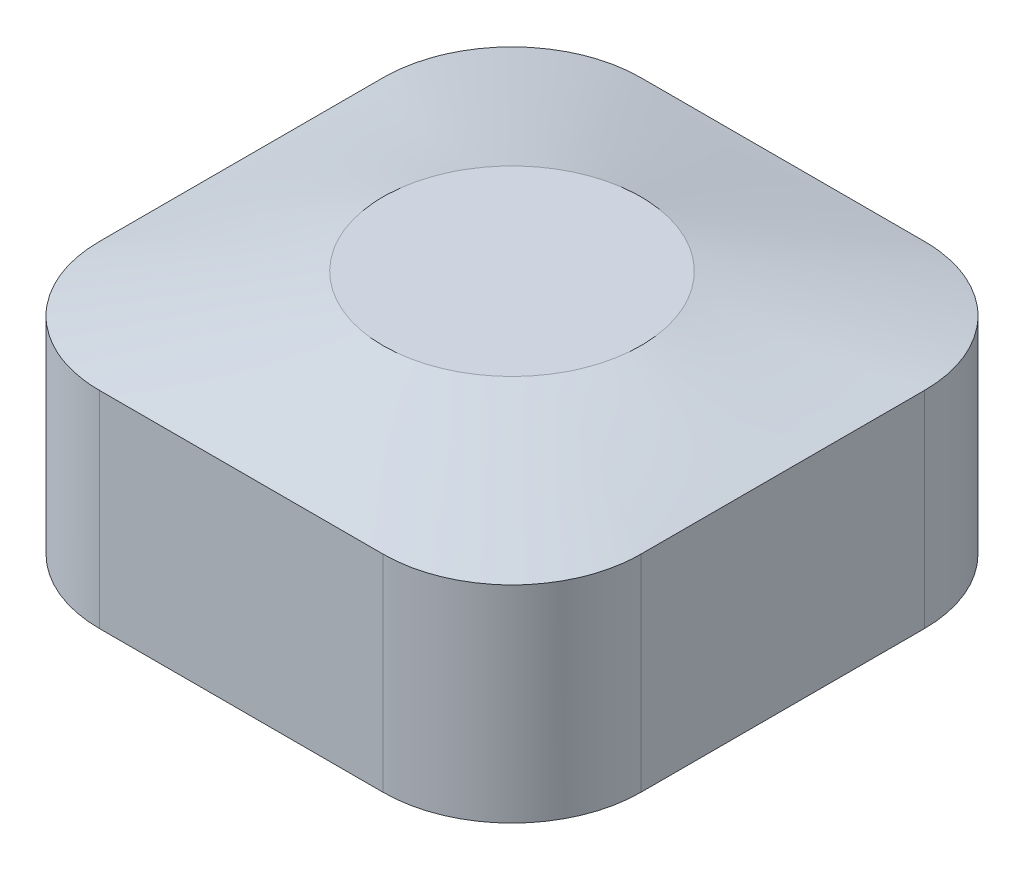
ISO-10303-21;
HEADER;
FILE_DESCRIPTION(('STEP AP214'),'2;1');
FILE_NAME('part.step','',(''),(''),'','','');
FILE_SCHEMA(('AUTOMOTIVE_DESIGN { 1 0 10303 214 1 1 1 1 }'));
ENDSEC;
DATA;
#1=APPLICATION_CONTEXT('core data for automotive mechanical design processes');
#2=APPLICATION_PROTOCOL_DEFINITION('international standard','automotive_design',2000,#1);
#3=PRODUCT_CONTEXT('',#1,'mechanical');
#4=PRODUCT('Part','Part','',(#3));
#5=PRODUCT_RELATED_PRODUCT_CATEGORY('part','',(#4));
#6=PRODUCT_DEFINITION_FORMATION('','',#4);
#7=PRODUCT_DEFINITION_CONTEXT('part definition',#1,'design');
#8=PRODUCT_DEFINITION('design','',#6,#7);
#9=PRODUCT_DEFINITION_SHAPE('','',#8);
#10=(LENGTH_UNIT() NAMED_UNIT(*) SI_UNIT(.MILLI.,.METRE.));
#11=(NAMED_UNIT(*) PLANE_ANGLE_UNIT() SI_UNIT($,.RADIAN.));
#12=(NAMED_UNIT(*) SI_UNIT($,.STERADIAN.) SOLID_ANGLE_UNIT());
#13=UNCERTAINTY_MEASURE_WITH_UNIT(LENGTH_MEASURE(1.E-05),#10,'distance_accuracy_value','');
#14=(GEOMETRIC_REPRESENTATION_CONTEXT(3) GLOBAL_UNCERTAINTY_ASSIGNED_CONTEXT((#13)) GLOBAL_UNIT_ASSIGNED_CONTEXT((#10,
#11,#12)) REPRESENTATION_CONTEXT('',''));
#15=CARTESIAN_POINT('',(0.,0.,0.));
#16=DIRECTION('',(0.,0.,1.));
#17=DIRECTION('',(1.,0.,0.));
#18=AXIS2_PLACEMENT_3D('',#15,#16,#17);
#19=CARTESIAN_POINT('',(0.,8.,21.));
#20=DIRECTION('',(1.,0.,0.));
#21=DIRECTION('',(0.,0.,-1.));
#22=AXIS2_PLACEMENT_3D('',#19,#20,#21);
#23=PLANE('',#22);
#24=DIRECTION('',(0.,0.,-1.));
#25=VECTOR('',#24,1.);
#26=CARTESIAN_POINT('',(0.,8.,21.));
#27=LINE('',#26,#25);
#28=CARTESIAN_POINT('',(0.,8.,5.));
#29=VERTEX_POINT('',#28);
#30=CARTESIAN_POINT('',(0.,8.,16.));
#31=VERTEX_POINT('',#30);
#32=EDGE_CURVE('E338',#29,#31,#27,.F.);
#33=ORIENTED_EDGE('',*,*,#32,.F.);
#34=DIRECTION('',(0.,-1.,0.));
#35=VECTOR('',#34,1.);
#36=CARTESIAN_POINT('',(0.,8.,5.));
#37=LINE('',#36,#35);
#38=CARTESIAN_POINT('',(0.,0.,5.));
#39=VERTEX_POINT('',#38);
#40=EDGE_CURVE('E323',#29,#39,#37,.T.);
#41=ORIENTED_EDGE('',*,*,#40,.T.);
#42=DIRECTION('',(0.,0.,1.));
#43=VECTOR('',#42,1.);
#44=CARTESIAN_POINT('',(0.,0.,21.));
#45=LINE('',#44,#43);
#46=CARTESIAN_POINT('',(0.,0.,16.));
#47=VERTEX_POINT('',#46);
#48=EDGE_CURVE('E408',#39,#47,#45,.T.);
#49=ORIENTED_EDGE('',*,*,#48,.T.);
#50=DIRECTION('',(0.,-1.,0.));
#51=VECTOR('',#50,1.);
#52=CARTESIAN_POINT('',(0.,8.,16.));
#53=LINE('',#52,#51);
#54=EDGE_CURVE('E331',#47,#31,#53,.F.);
#55=ORIENTED_EDGE('',*,*,#54,.T.);
#56=EDGE_LOOP('',(#33,#41,#49,#55));
#57=FACE_BOUND('',#56,.T.);
#58=ADVANCED_FACE('F194',(#57),#23,.F.);
#59=CARTESIAN_POINT('',(21.,8.,21.));
#60=DIRECTION('',(0.,0.,-1.));
#61=DIRECTION('',(-1.,0.,0.));
#62=AXIS2_PLACEMENT_3D('',#59,#60,#61);
#63=PLANE('',#62);
#64=DIRECTION('',(1.,0.,0.));
#65=VECTOR('',#64,1.);
#66=CARTESIAN_POINT('',(21.,0.,21.));
#67=LINE('',#66,#65);
#68=CARTESIAN_POINT('',(5.,0.,21.));
#69=VERTEX_POINT('',#68);
#70=CARTESIAN_POINT('',(16.,0.,21.));
#71=VERTEX_POINT('',#70);
#72=EDGE_CURVE('E406',#69,#71,#67,.T.);
#73=ORIENTED_EDGE('',*,*,#72,.T.);
#74=DIRECTION('',(0.,-1.,0.));
#75=VECTOR('',#74,1.);
#76=CARTESIAN_POINT('',(16.,8.,21.));
#77=LINE('',#76,#75);
#78=CARTESIAN_POINT('',(16.,8.,21.));
#79=VERTEX_POINT('',#78);
#80=EDGE_CURVE('E205',#71,#79,#77,.F.);
#81=ORIENTED_EDGE('',*,*,#80,.T.);
#82=DIRECTION('',(-1.,0.,0.));
#83=VECTOR('',#82,1.);
#84=CARTESIAN_POINT('',(21.,8.,21.));
#85=LINE('',#84,#83);
#86=CARTESIAN_POINT('',(5.,8.,21.));
#87=VERTEX_POINT('',#86);
#88=EDGE_CURVE('E334',#87,#79,#85,.F.);
#89=ORIENTED_EDGE('',*,*,#88,.F.);
#90=DIRECTION('',(0.,-1.,0.));
#91=VECTOR('',#90,1.);
#92=CARTESIAN_POINT('',(5.,8.,21.));
#93=LINE('',#92,#91);
#94=EDGE_CURVE('E383',#87,#69,#93,.T.);
#95=ORIENTED_EDGE('',*,*,#94,.T.);
#96=EDGE_LOOP('',(#73,#81,#89,#95));
#97=FACE_BOUND('',#96,.T.);
#98=ADVANCED_FACE('F540',(#97),#63,.F.);
#99=CARTESIAN_POINT('',(21.,8.,0.));
#100=DIRECTION('',(-1.,0.,0.));
#101=DIRECTION('',(0.,0.,1.));
#102=AXIS2_PLACEMENT_3D('',#99,#100,#101);
#103=PLANE('',#102);
#104=DIRECTION('',(0.,0.,-1.));
#105=VECTOR('',#104,1.);
#106=CARTESIAN_POINT('',(21.,0.,0.));
#107=LINE('',#106,#105);
#108=CARTESIAN_POINT('',(21.,0.,16.));
#109=VERTEX_POINT('',#108);
#110=CARTESIAN_POINT('',(21.,0.,5.));
#111=VERTEX_POINT('',#110);
#112=EDGE_CURVE('E403',#109,#111,#107,.T.);
#113=ORIENTED_EDGE('',*,*,#112,.T.);
#114=DIRECTION('',(0.,-1.,0.));
#115=VECTOR('',#114,1.);
#116=CARTESIAN_POINT('',(21.,8.,5.));
#117=LINE('',#116,#115);
#118=CARTESIAN_POINT('',(21.,8.,5.));
#119=VERTEX_POINT('',#118);
#120=EDGE_CURVE('E385',#111,#119,#117,.F.);
#121=ORIENTED_EDGE('',*,*,#120,.T.);
#122=DIRECTION('',(0.,0.,1.));
#123=VECTOR('',#122,1.);
#124=CARTESIAN_POINT('',(21.,8.,0.));
#125=LINE('',#124,#123);
#126=CARTESIAN_POINT('',(21.,8.,16.));
#127=VERTEX_POINT('',#126);
#128=EDGE_CURVE('E332',#127,#119,#125,.F.);
#129=ORIENTED_EDGE('',*,*,#128,.F.);
#130=DIRECTION('',(0.,-1.,0.));
#131=VECTOR('',#130,1.);
#132=CARTESIAN_POINT('',(21.,8.,16.));
#133=LINE('',#132,#131);
#134=EDGE_CURVE('E326',#127,#109,#133,.T.);
#135=ORIENTED_EDGE('',*,*,#134,.T.);
#136=EDGE_LOOP('',(#113,#121,#129,#135));
#137=FACE_BOUND('',#136,.T.);
#138=ADVANCED_FACE('F538',(#137),#103,.F.);
#139=CARTESIAN_POINT('',(0.,8.,0.));
#140=DIRECTION('',(0.,0.,1.));
#141=DIRECTION('',(1.,0.,0.));
#142=AXIS2_PLACEMENT_3D('',#139,#140,#141);
#143=PLANE('',#142);
#144=DIRECTION('',(-1.,0.,0.));
#145=VECTOR('',#144,1.);
#146=CARTESIAN_POINT('',(0.,0.,0.));
#147=LINE('',#146,#145);
#148=CARTESIAN_POINT('',(16.,0.,0.));
#149=VERTEX_POINT('',#148);
#150=CARTESIAN_POINT('',(5.,0.,0.));
#151=VERTEX_POINT('',#150);
#152=EDGE_CURVE('E314',#149,#151,#147,.T.);
#153=ORIENTED_EDGE('',*,*,#152,.T.);
#154=DIRECTION('',(0.,-1.,0.));
#155=VECTOR('',#154,1.);
#156=CARTESIAN_POINT('',(5.,8.,0.));
#157=LINE('',#156,#155);
#158=CARTESIAN_POINT('',(5.,8.,0.));
#159=VERTEX_POINT('',#158);
#160=EDGE_CURVE('E308',#151,#159,#157,.F.);
#161=ORIENTED_EDGE('',*,*,#160,.T.);
#162=DIRECTION('',(1.,0.,0.));
#163=VECTOR('',#162,1.);
#164=CARTESIAN_POINT('',(0.,8.,0.));
#165=LINE('',#164,#163);
#166=CARTESIAN_POINT('',(16.,8.,0.));
#167=VERTEX_POINT('',#166);
#168=EDGE_CURVE('E199',#167,#159,#165,.F.);
#169=ORIENTED_EDGE('',*,*,#168,.F.);
#170=DIRECTION('',(0.,-1.,0.));
#171=VECTOR('',#170,1.);
#172=CARTESIAN_POINT('',(16.,8.,0.));
#173=LINE('',#172,#171);
#174=EDGE_CURVE('E245',#167,#149,#173,.T.);
#175=ORIENTED_EDGE('',*,*,#174,.T.);
#176=EDGE_LOOP('',(#153,#161,#169,#175));
#177=FACE_BOUND('',#176,.T.);
#178=ADVANCED_FACE('F310',(#177),#143,.F.);
#179=CARTESIAN_POINT('',(0.,0.,0.));
#180=DIRECTION('',(0.,-1.,0.));
#181=DIRECTION('',(0.,0.,-1.));
#182=AXIS2_PLACEMENT_3D('',#179,#180,#181);
#183=PLANE('',#182);
#184=CARTESIAN_POINT('',(5.,0.,5.));
#185=DIRECTION('',(0.,-1.,0.));
#186=DIRECTION('',(0.,0.,1.));
#187=AXIS2_PLACEMENT_3D('',#184,#185,#186);
#188=CIRCLE('',#187,3.5);
#189=CARTESIAN_POINT('',(1.5,0.,5.00000000000002));
#190=VERTEX_POINT('',#189);
#191=CARTESIAN_POINT('',(5.00000000000002,0.,1.5));
#192=VERTEX_POINT('',#191);
#193=EDGE_CURVE('E214',#190,#192,#188,.T.);
#194=ORIENTED_EDGE('',*,*,#193,.F.);
#195=DIRECTION('',(0.,0.,-1.));
#196=VECTOR('',#195,1.);
#197=CARTESIAN_POINT('',(1.5,0.,5.00000000000002));
#198=LINE('',#197,#196);
#199=CARTESIAN_POINT('',(1.5,0.,16.));
#200=VERTEX_POINT('',#199);
#201=EDGE_CURVE('E426',#200,#190,#198,.T.);
#202=ORIENTED_EDGE('',*,*,#201,.F.);
#203=CARTESIAN_POINT('',(5.,0.,16.));
#204=DIRECTION('',(0.,-1.,0.));
#205=DIRECTION('',(0.,0.,-1.));
#206=AXIS2_PLACEMENT_3D('',#203,#204,#205);
#207=CIRCLE('',#206,3.5);
#208=CARTESIAN_POINT('',(5.00000000000002,0.,19.5));
#209=VERTEX_POINT('',#208);
#210=EDGE_CURVE('E430',#209,#200,#207,.T.);
#211=ORIENTED_EDGE('',*,*,#210,.F.);
#212=DIRECTION('',(-1.,0.,0.));
#213=VECTOR('',#212,1.);
#214=CARTESIAN_POINT('',(5.00000000000002,0.,19.5));
#215=LINE('',#214,#213);
#216=CARTESIAN_POINT('',(16.,0.,19.5));
#217=VERTEX_POINT('',#216);
#218=EDGE_CURVE('E433',#217,#209,#215,.T.);
#219=ORIENTED_EDGE('',*,*,#218,.F.);
#220=CARTESIAN_POINT('',(16.,0.,16.));
#221=DIRECTION('',(0.,-1.,0.));
#222=DIRECTION('',(0.,0.,1.));
#223=AXIS2_PLACEMENT_3D('',#220,#221,#222);
#224=CIRCLE('',#223,3.5);
#225=CARTESIAN_POINT('',(19.5,0.,16.));
#226=VERTEX_POINT('',#225);
#227=EDGE_CURVE('E436',#226,#217,#224,.T.);
#228=ORIENTED_EDGE('',*,*,#227,.F.);
#229=DIRECTION('',(0.,0.,1.));
#230=VECTOR('',#229,1.);
#231=CARTESIAN_POINT('',(19.5,0.,5.00000000000002));
#232=LINE('',#231,#230);
#233=CARTESIAN_POINT('',(19.5,0.,5.00000000000002));
#234=VERTEX_POINT('',#233);
#235=EDGE_CURVE('E439',#234,#226,#232,.T.);
#236=ORIENTED_EDGE('',*,*,#235,.F.);
#237=CARTESIAN_POINT('',(16.,0.,5.));
#238=DIRECTION('',(0.,-1.,0.));
#239=DIRECTION('',(0.,0.,-1.));
#240=AXIS2_PLACEMENT_3D('',#237,#238,#239);
#241=CIRCLE('',#240,3.5);
#242=CARTESIAN_POINT('',(16.,0.,1.5));
#243=VERTEX_POINT('',#242);
#244=EDGE_CURVE('E442',#243,#234,#241,.T.);
#245=ORIENTED_EDGE('',*,*,#244,.F.);
#246=DIRECTION('',(1.,0.,0.));
#247=VECTOR('',#246,1.);
#248=CARTESIAN_POINT('',(5.00000000000002,0.,1.5));
#249=LINE('',#248,#247);
#250=EDGE_CURVE('E444',#192,#243,#249,.T.);
#251=ORIENTED_EDGE('',*,*,#250,.F.);
#252=EDGE_LOOP('',(#194,#202,#211,#219,#228,#236,#245,#251));
#253=FACE_BOUND('',#252,.T.);
#254=ORIENTED_EDGE('',*,*,#48,.F.);
#255=CARTESIAN_POINT('',(5.,0.,5.));
#256=DIRECTION('',(0.,-1.,0.));
#257=DIRECTION('',(0.,0.,-1.));
#258=AXIS2_PLACEMENT_3D('',#255,#256,#257);
#259=CIRCLE('',#258,5.);
#260=EDGE_CURVE('E392',#39,#151,#259,.T.);
#261=ORIENTED_EDGE('',*,*,#260,.T.);
#262=ORIENTED_EDGE('',*,*,#152,.F.);
#263=CARTESIAN_POINT('',(16.,0.,5.));
#264=DIRECTION('',(0.,-1.,0.));
#265=DIRECTION('',(0.,0.,-1.));
#266=AXIS2_PLACEMENT_3D('',#263,#264,#265);
#267=CIRCLE('',#266,5.);
#268=EDGE_CURVE('E393',#149,#111,#267,.T.);
#269=ORIENTED_EDGE('',*,*,#268,.T.);
#270=ORIENTED_EDGE('',*,*,#112,.F.);
#271=CARTESIAN_POINT('',(16.,0.,16.));
#272=DIRECTION('',(0.,-1.,0.));
#273=DIRECTION('',(0.,0.,-1.));
#274=AXIS2_PLACEMENT_3D('',#271,#272,#273);
#275=CIRCLE('',#274,5.);
#276=EDGE_CURVE('E302',#109,#71,#275,.T.);
#277=ORIENTED_EDGE('',*,*,#276,.T.);
#278=ORIENTED_EDGE('',*,*,#72,.F.);
#279=CARTESIAN_POINT('',(5.,0.,16.));
#280=DIRECTION('',(0.,-1.,0.));
#281=DIRECTION('',(0.,0.,-1.));
#282=AXIS2_PLACEMENT_3D('',#279,#280,#281);
#283=CIRCLE('',#282,5.);
#284=EDGE_CURVE('E296',#69,#47,#283,.T.);
#285=ORIENTED_EDGE('',*,*,#284,.T.);
#286=EDGE_LOOP('',(#254,#261,#262,#269,#270,#277,#278,#285));
#287=FACE_BOUND('',#286,.T.);
#288=ADVANCED_FACE('F370',(#253,#287),#183,.T.);
#289=CARTESIAN_POINT('',(5.,8.,5.));
#290=DIRECTION('',(0.,-1.,0.));
#291=DIRECTION('',(0.,0.,-1.));
#292=AXIS2_PLACEMENT_3D('',#289,#290,#291);
#293=CYLINDRICAL_SURFACE('',#292,5.);
#294=CARTESIAN_POINT('',(5.,8.,0.));
#295=CARTESIAN_POINT('',(4.85936970750515,7.99999129194583,-1.51218900040859E-05));
#296=CARTESIAN_POINT('',(4.71874158628322,7.99997355052632,0.00593242913028755));
#297=CARTESIAN_POINT('',(4.43849150855544,7.99994383210181,0.02964365638705));
#298=CARTESIAN_POINT('',(4.29886950408125,7.99993185482019,0.0474067654780275));
#299=CARTESIAN_POINT('',(4.02172453622357,7.99993748827671,0.0946220630589021));
#300=CARTESIAN_POINT('',(3.88420006652193,7.99995507666503,0.124065409155688));
#301=CARTESIAN_POINT('',(3.61212052836341,8.00000385765287,0.194426989417875));
#302=CARTESIAN_POINT('',(3.47756542365326,8.0000350500862,0.235345083403256));
#303=CARTESIAN_POINT('',(3.21231481971966,8.00006332591643,0.328389383977522));
#304=CARTESIAN_POINT('',(3.08162121354892,8.00006039285302,0.380520987464815));
#305=CARTESIAN_POINT('',(2.82508938973149,8.0000218352322,0.49561021061234));
#306=CARTESIAN_POINT('',(2.69925122203098,7.99998621033859,0.558567941600787));
#307=CARTESIAN_POINT('',(2.45334849129507,7.99994136349724,0.69484927074059));
#308=CARTESIAN_POINT('',(2.33328289972929,7.99993213682872,0.76817101303993));
#309=CARTESIAN_POINT('',(2.0997553303439,7.99994417630345,0.924667218210526));
#310=CARTESIAN_POINT('',(1.98629331698032,7.99996544228255,1.00784162804216));
#311=CARTESIAN_POINT('',(1.76677985078452,8.00002266889553,1.18345136293889));
#312=CARTESIAN_POINT('',(1.6607283211054,8.00005862937701,1.27588659194486));
#313=CARTESIAN_POINT('',(1.45678778632512,8.00008245589123,1.46936217396569));
#314=CARTESIAN_POINT('',(1.35889882473455,8.00007032166764,1.57040257284465));
#315=CARTESIAN_POINT('',(1.1719784250637,8.00002319960231,1.78037150661225));
#316=CARTESIAN_POINT('',(1.08294712386945,7.99998821140747,1.88930016336087));
#317=CARTESIAN_POINT('',(0.914346610479957,7.99994277874181,2.11430988698469));
#318=CARTESIAN_POINT('',(0.834780775182089,7.99993234300555,2.23039348416636));
#319=CARTESIAN_POINT('',(0.685712713012557,7.99994312804332,2.46885474686353));
#320=CARTESIAN_POINT('',(0.61621064840524,7.99996434932771,2.59123251382069));
#321=CARTESIAN_POINT('',(0.487765911822458,8.00001884781211,2.84140862584924));
#322=CARTESIAN_POINT('',(0.428823284975618,8.00005212506364,2.96920699408416));
#323=CARTESIAN_POINT('',(0.321942278865139,8.00006730052975,3.22925879536026));
#324=CARTESIAN_POINT('',(0.273998620558982,8.00004922344826,3.36151005609974));
#325=CARTESIAN_POINT('',(0.189431200858348,8.0000022457977,3.62953178129152));
#326=CARTESIAN_POINT('',(0.152804974755087,7.9999733475883,3.7653014725098));
#327=CARTESIAN_POINT('',(0.0814490492722305,7.99993241236263,4.08246147584534));
#328=CARTESIAN_POINT('',(0.0509066661031185,7.99992849172685,4.26482114457164));
#329=CARTESIAN_POINT('',(0.0203662633614121,7.99995273146828,4.5398246714185));
#330=CARTESIAN_POINT('',(0.0127316645339142,7.99996581731495,4.63168980797857));
#331=CARTESIAN_POINT('',(0.00254914589946658,7.99998870102009,4.81569576368986));
#332=CARTESIAN_POINT('',(9.04145101973112E-07,7.99999849908663,4.90783656502278));
#333=CARTESIAN_POINT('',(0.,8.,5.));
#334=B_SPLINE_CURVE_WITH_KNOTS('',3,(#294,#295,#296,#297,#298,#299,#300,#301,#302,#303,#304,
#305,#306,#307,#308,#309,#310,#311,#312,#313,#314,#315,#316,#317,#318,#319,#320,#321,#322,#323,
#324,#325,#326,#327,#328,#329,#330,#331,#332,#333),.UNSPECIFIED.,.F.,.F.,(4,2,2,2,2,2,2,2,2,2,2,
2,2,2,2,2,2,2,2,4),(0.,0.421762106520806,0.843503969967427,1.26492716586672,1.6863452137192,
2.10796653956105,2.52959220131679,2.95114245926693,3.37269044799903,3.79423406461929,
4.21577992813647,4.63733230520033,5.05903462702221,5.48074374745231,5.90245467012786,
6.3239627638537,6.74537899680378,7.29879131433035,7.57521872703975,7.85162864237094),.UNSPECIFIED.);
#335=EDGE_CURVE('E320',#159,#29,#334,.T.);
#336=ORIENTED_EDGE('',*,*,#335,.F.);
#337=ORIENTED_EDGE('',*,*,#160,.F.);
#338=ORIENTED_EDGE('',*,*,#260,.F.);
#339=ORIENTED_EDGE('',*,*,#40,.F.);
#340=EDGE_LOOP('',(#336,#337,#338,#339));
#341=FACE_BOUND('',#340,.T.);
#342=ADVANCED_FACE('F321',(#341),#293,.T.);
#343=CARTESIAN_POINT('',(16.,8.,5.));
#344=DIRECTION('',(0.,-1.,0.));
#345=DIRECTION('',(0.,0.,-1.));
#346=AXIS2_PLACEMENT_3D('',#343,#344,#345);
#347=CYLINDRICAL_SURFACE('',#346,5.);
#348=CARTESIAN_POINT('',(21.,8.,5.));
#349=CARTESIAN_POINT('',(21.00001512189,7.99999129194583,4.85936970750515));
#350=CARTESIAN_POINT('',(20.9940675708697,7.99997355052632,4.71874158628322));
#351=CARTESIAN_POINT('',(20.970356343613,7.99994383210181,4.43849150855545));
#352=CARTESIAN_POINT('',(20.952593234522,7.99993185482019,4.29886950408125));
#353=CARTESIAN_POINT('',(20.9053779369411,7.99993748827672,4.02172453622357));
#354=CARTESIAN_POINT('',(20.8759345908443,7.99995507666504,3.88420006652193));
#355=CARTESIAN_POINT('',(20.8055730105821,8.00000385765288,3.61212052836341));
#356=CARTESIAN_POINT('',(20.7646549165967,8.00003505008621,3.47756542365327));
#357=CARTESIAN_POINT('',(20.6716106160225,8.00006332591644,3.21231481971966));
#358=CARTESIAN_POINT('',(20.6194790125352,8.00006039285303,3.08162121354892));
#359=CARTESIAN_POINT('',(20.5043897893877,8.00002183523221,2.82508938973149));
#360=CARTESIAN_POINT('',(20.4414320583992,7.99998621033859,2.69925122203098));
#361=CARTESIAN_POINT('',(20.3051507292594,7.99994136349724,2.45334849129507));
#362=CARTESIAN_POINT('',(20.2318289869601,7.99993213682872,2.33328289972929));
#363=CARTESIAN_POINT('',(20.0753327817895,7.99994417630345,2.0997553303439));
#364=CARTESIAN_POINT('',(19.9921583719578,7.99996544228254,1.98629331698032));
#365=CARTESIAN_POINT('',(19.8165486370611,8.00002266889553,1.76677985078452));
#366=CARTESIAN_POINT('',(19.7241134080551,8.000058629377,1.6607283211054));
#367=CARTESIAN_POINT('',(19.5306378260343,8.00008245589123,1.45678778632511));
#368=CARTESIAN_POINT('',(19.4295974271554,8.00007032166762,1.35889882473455));
#369=CARTESIAN_POINT('',(19.2196284933878,8.0000231996023,1.1719784250637));
#370=CARTESIAN_POINT('',(19.1106998366391,7.99998821140745,1.08294712386945));
#371=CARTESIAN_POINT('',(18.8856901130153,7.9999427787418,0.914346610479958));
#372=CARTESIAN_POINT('',(18.7696065158336,7.99993234300554,0.83478077518209));
#373=CARTESIAN_POINT('',(18.5311452531365,7.99994312804331,0.685712713012558));
#374=CARTESIAN_POINT('',(18.4087674861793,7.99996434932772,0.61621064840524));
#375=CARTESIAN_POINT('',(18.1585913741508,8.00001884781212,0.487765911822457));
#376=CARTESIAN_POINT('',(18.0307930059158,8.00005212506364,0.428823284975617));
#377=CARTESIAN_POINT('',(17.7707412046397,8.00006730052976,0.321942278865138));
#378=CARTESIAN_POINT('',(17.6384899439003,8.00004922344826,0.273998620558981));
#379=CARTESIAN_POINT('',(17.3704682187085,8.0000022457977,0.189431200858348));
#380=CARTESIAN_POINT('',(17.2346985274902,7.9999733475883,0.152804974755087));
#381=CARTESIAN_POINT('',(16.9175385241547,7.99993241236262,0.08144904927223));
#382=CARTESIAN_POINT('',(16.7351788554284,7.99992849172686,0.0509066661031176));
#383=CARTESIAN_POINT('',(16.4601753285815,7.99995273146829,0.0203662633614115));
#384=CARTESIAN_POINT('',(16.3683101920214,7.99996581731495,0.0127316645339139));
#385=CARTESIAN_POINT('',(16.1843042363101,7.99998870102009,0.00254914589946659));
#386=CARTESIAN_POINT('',(16.0921634349772,7.99999849908663,9.04145101966269E-07));
#387=CARTESIAN_POINT('',(16.,8.,0.));
#388=B_SPLINE_CURVE_WITH_KNOTS('',3,(#348,#349,#350,#351,#352,#353,#354,#355,#356,#357,#358,
#359,#360,#361,#362,#363,#364,#365,#366,#367,#368,#369,#370,#371,#372,#373,#374,#375,#376,#377,
#378,#379,#380,#381,#382,#383,#384,#385,#386,#387),.UNSPECIFIED.,.F.,.F.,(4,2,2,2,2,2,2,2,2,2,2,
2,2,2,2,2,2,2,2,4),(0.,0.421762106520807,0.843503969967428,1.26492716586672,1.6863452137192,
2.10796653956106,2.5295922013168,2.95114245926694,3.37269044799903,3.79423406461929,
4.21577992813647,4.63733230520033,5.05903462702222,5.48074374745232,5.90245467012787,
6.32396276385371,6.74537899680379,7.29879131433036,7.57521872703976,7.85162864237095),.UNSPECIFIED.);
#389=EDGE_CURVE('E327',#119,#167,#388,.T.);
#390=ORIENTED_EDGE('',*,*,#389,.F.);
#391=ORIENTED_EDGE('',*,*,#120,.F.);
#392=ORIENTED_EDGE('',*,*,#268,.F.);
#393=ORIENTED_EDGE('',*,*,#174,.F.);
#394=EDGE_LOOP('',(#390,#391,#392,#393));
#395=FACE_BOUND('',#394,.T.);
#396=ADVANCED_FACE('F362',(#395),#347,.T.);
#397=CARTESIAN_POINT('',(16.,8.,16.));
#398=DIRECTION('',(0.,-1.,0.));
#399=DIRECTION('',(0.,0.,-1.));
#400=AXIS2_PLACEMENT_3D('',#397,#398,#399);
#401=CYLINDRICAL_SURFACE('',#400,5.);
#402=CARTESIAN_POINT('',(16.,8.,21.));
#403=CARTESIAN_POINT('',(16.1406302924949,7.99999129194584,21.00001512189));
#404=CARTESIAN_POINT('',(16.2812584137168,7.99997355052632,20.9940675708697));
#405=CARTESIAN_POINT('',(16.5615084914446,7.99994383210182,20.970356343613));
#406=CARTESIAN_POINT('',(16.7011304959188,7.99993185482019,20.952593234522));
#407=CARTESIAN_POINT('',(16.9782754637765,7.99993748827672,20.9053779369411));
#408=CARTESIAN_POINT('',(17.1157999334781,7.99995507666504,20.8759345908443));
#409=CARTESIAN_POINT('',(17.3878794716366,8.00000385765288,20.8055730105821));
#410=CARTESIAN_POINT('',(17.5224345763468,8.00003505008621,20.7646549165967));
#411=CARTESIAN_POINT('',(17.7876851802804,8.00006332591644,20.6716106160225));
#412=CARTESIAN_POINT('',(17.9183787864511,8.00006039285303,20.6194790125352));
#413=CARTESIAN_POINT('',(18.1749106102685,8.0000218352322,20.5043897893877));
#414=CARTESIAN_POINT('',(18.300748777969,7.99998621033859,20.4414320583992));
#415=CARTESIAN_POINT('',(18.5466515087049,7.99994136349724,20.3051507292594));
#416=CARTESIAN_POINT('',(18.6667171002707,7.99993213682872,20.2318289869601));
#417=CARTESIAN_POINT('',(18.9002446696561,7.99994417630344,20.0753327817895));
#418=CARTESIAN_POINT('',(19.0137066830197,7.99996544228254,19.9921583719578));
#419=CARTESIAN_POINT('',(19.2332201492155,8.00002266889553,19.8165486370611));
#420=CARTESIAN_POINT('',(19.3392716788946,8.000058629377,19.7241134080551));
#421=CARTESIAN_POINT('',(19.5432122136749,8.00008245589123,19.5306378260343));
#422=CARTESIAN_POINT('',(19.6411011752655,8.00007032166763,19.4295974271553));
#423=CARTESIAN_POINT('',(19.8280215749363,8.0000231996023,19.2196284933877));
#424=CARTESIAN_POINT('',(19.9170528761306,7.99998821140745,19.1106998366391));
#425=CARTESIAN_POINT('',(20.0856533895201,7.9999427787418,18.8856901130153));
#426=CARTESIAN_POINT('',(20.1652192248179,7.99993234300554,18.7696065158336));
#427=CARTESIAN_POINT('',(20.3142872869875,7.99994312804331,18.5311452531365));
#428=CARTESIAN_POINT('',(20.3837893515948,7.99996434932771,18.4087674861793));
#429=CARTESIAN_POINT('',(20.5122340881776,8.00001884781211,18.1585913741507));
#430=CARTESIAN_POINT('',(20.5711767150244,8.00005212506364,18.0307930059158));
#431=CARTESIAN_POINT('',(20.6780577211349,8.00006730052976,17.7707412046397));
#432=CARTESIAN_POINT('',(20.726001379441,8.00004922344826,17.6384899439002));
#433=CARTESIAN_POINT('',(20.8105687991417,8.0000022457977,17.3704682187085));
#434=CARTESIAN_POINT('',(20.8471950252449,7.9999733475883,17.2346985274902));
#435=CARTESIAN_POINT('',(20.9185509507278,7.99993241236263,16.9175385241546));
#436=CARTESIAN_POINT('',(20.9490933338969,7.99992849172686,16.7351788554283));
#437=CARTESIAN_POINT('',(20.9796337366386,7.99995273146829,16.4601753285815));
#438=CARTESIAN_POINT('',(20.9872683354661,7.99996581731495,16.3683101920214));
#439=CARTESIAN_POINT('',(20.9974508541005,7.99998870102009,16.1843042363101));
#440=CARTESIAN_POINT('',(20.9999990958549,7.99999849908663,16.0921634349772));
#441=CARTESIAN_POINT('',(21.,8.,16.));
#442=B_SPLINE_CURVE_WITH_KNOTS('',3,(#402,#403,#404,#405,#406,#407,#408,#409,#410,#411,#412,
#413,#414,#415,#416,#417,#418,#419,#420,#421,#422,#423,#424,#425,#426,#427,#428,#429,#430,#431,
#432,#433,#434,#435,#436,#437,#438,#439,#440,#441),.UNSPECIFIED.,.F.,.F.,(4,2,2,2,2,2,2,2,2,2,2,
2,2,2,2,2,2,2,2,4),(0.,0.42176210652081,0.843503969967436,1.26492716586673,1.68634521371921,
2.10796653956106,2.5295922013168,2.95114245926694,3.37269044799904,3.7942340646193,
4.21577992813648,4.63733230520035,5.05903462702223,5.48074374745233,5.90245467012788,
6.32396276385373,6.7453789968038,7.29879131433036,7.57521872703976,7.85162864237093),.UNSPECIFIED.);
#443=EDGE_CURVE('E349',#79,#127,#442,.T.);
#444=ORIENTED_EDGE('',*,*,#443,.F.);
#445=ORIENTED_EDGE('',*,*,#80,.F.);
#446=ORIENTED_EDGE('',*,*,#276,.F.);
#447=ORIENTED_EDGE('',*,*,#134,.F.);
#448=EDGE_LOOP('',(#444,#445,#446,#447));
#449=FACE_BOUND('',#448,.T.);
#450=ADVANCED_FACE('F359',(#449),#401,.T.);
#451=CARTESIAN_POINT('',(5.,8.,16.));
#452=DIRECTION('',(0.,-1.,0.));
#453=DIRECTION('',(0.,0.,-1.));
#454=AXIS2_PLACEMENT_3D('',#451,#452,#453);
#455=CYLINDRICAL_SURFACE('',#454,5.);
#456=CARTESIAN_POINT('',(0.,8.,16.));
#457=CARTESIAN_POINT('',(-1.5121890003863E-05,7.99999129194584,16.1406302924949));
#458=CARTESIAN_POINT('',(0.00593242913028772,7.99997355052632,16.2812584137168));
#459=CARTESIAN_POINT('',(0.0296436563870498,7.99994383210182,16.5615084914446));
#460=CARTESIAN_POINT('',(0.0474067654780271,7.99993185482019,16.7011304959188));
#461=CARTESIAN_POINT('',(0.0946220630589016,7.99993748827671,16.9782754637764));
#462=CARTESIAN_POINT('',(0.124065409155687,7.99995507666504,17.1157999334781));
#463=CARTESIAN_POINT('',(0.194426989417875,8.00000385765287,17.3878794716366));
#464=CARTESIAN_POINT('',(0.235345083403256,8.0000350500862,17.5224345763467));
#465=CARTESIAN_POINT('',(0.328389383977522,8.00006332591644,17.7876851802803));
#466=CARTESIAN_POINT('',(0.380520987464814,8.00006039285303,17.9183787864511));
#467=CARTESIAN_POINT('',(0.495610210612339,8.0000218352322,18.1749106102685));
#468=CARTESIAN_POINT('',(0.558567941600787,7.99998621033859,18.300748777969));
#469=CARTESIAN_POINT('',(0.694849270740591,7.99994136349724,18.5466515087049));
#470=CARTESIAN_POINT('',(0.768171013039931,7.99993213682872,18.6667171002707));
#471=CARTESIAN_POINT('',(0.924667218210528,7.99994417630345,18.9002446696561));
#472=CARTESIAN_POINT('',(1.00784162804216,7.99996544228255,19.0137066830197));
#473=CARTESIAN_POINT('',(1.18345136293889,8.00002266889553,19.2332201492155));
#474=CARTESIAN_POINT('',(1.27588659194487,8.00005862937701,19.3392716788946));
#475=CARTESIAN_POINT('',(1.4693621739657,8.00008245589123,19.5432122136749));
#476=CARTESIAN_POINT('',(1.57040257284465,8.00007032166763,19.6411011752655));
#477=CARTESIAN_POINT('',(1.78037150661225,8.00002319960231,19.8280215749363));
#478=CARTESIAN_POINT('',(1.88930016336088,7.99998821140746,19.9170528761306));
#479=CARTESIAN_POINT('',(2.11430988698469,7.9999427787418,20.0856533895201));
#480=CARTESIAN_POINT('',(2.23039348416636,7.99993234300554,20.1652192248179));
#481=CARTESIAN_POINT('',(2.46885474686354,7.99994312804331,20.3142872869875));
#482=CARTESIAN_POINT('',(2.5912325138207,7.99996434932771,20.3837893515948));
#483=CARTESIAN_POINT('',(2.84140862584925,8.00001884781211,20.5122340881776));
#484=CARTESIAN_POINT('',(2.96920699408417,8.00005212506364,20.5711767150244));
#485=CARTESIAN_POINT('',(3.22925879536027,8.00006730052975,20.6780577211349));
#486=CARTESIAN_POINT('',(3.36151005609975,8.00004922344826,20.726001379441));
#487=CARTESIAN_POINT('',(3.62953178129152,8.0000022457977,20.8105687991417));
#488=CARTESIAN_POINT('',(3.76530147250981,7.9999733475883,20.8471950252449));
#489=CARTESIAN_POINT('',(4.08246147584534,7.99993241236262,20.9185509507278));
#490=CARTESIAN_POINT('',(4.26482114457164,7.99992849172686,20.9490933338969));
#491=CARTESIAN_POINT('',(4.53982467141851,7.99995273146829,20.9796337366386));
#492=CARTESIAN_POINT('',(4.63168980797857,7.99996581731495,20.9872683354661));
#493=CARTESIAN_POINT('',(4.81569576368986,7.99998870102009,20.9974508541005));
#494=CARTESIAN_POINT('',(4.90783656502278,7.99999849908663,20.9999990958549));
#495=CARTESIAN_POINT('',(5.,8.,21.));
#496=B_SPLINE_CURVE_WITH_KNOTS('',3,(#456,#457,#458,#459,#460,#461,#462,#463,#464,#465,#466,
#467,#468,#469,#470,#471,#472,#473,#474,#475,#476,#477,#478,#479,#480,#481,#482,#483,#484,#485,
#486,#487,#488,#489,#490,#491,#492,#493,#494,#495),.UNSPECIFIED.,.F.,.F.,(4,2,2,2,2,2,2,2,2,2,2,
2,2,2,2,2,2,2,2,4),(0.,0.421762106520806,0.843503969967431,1.26492716586672,1.6863452137192,
2.10796653956106,2.5295922013168,2.95114245926694,3.37269044799903,3.79423406461929,
4.21577992813648,4.63733230520034,5.05903462702223,5.48074374745233,5.90245467012787,
6.32396276385372,6.74537899680379,7.29879131433036,7.57521872703976,7.85162864237095),.UNSPECIFIED.);
#497=EDGE_CURVE('E316',#31,#87,#496,.T.);
#498=ORIENTED_EDGE('',*,*,#497,.F.);
#499=ORIENTED_EDGE('',*,*,#54,.F.);
#500=ORIENTED_EDGE('',*,*,#284,.F.);
#501=ORIENTED_EDGE('',*,*,#94,.F.);
#502=EDGE_LOOP('',(#498,#499,#500,#501));
#503=FACE_BOUND('',#502,.T.);
#504=ADVANCED_FACE('F196',(#503),#455,.T.);
#505=CARTESIAN_POINT('',(5.,6.5,5.));
#506=DIRECTION('',(0.,-1.,0.));
#507=DIRECTION('',(0.,0.,-1.));
#508=AXIS2_PLACEMENT_3D('',#505,#506,#507);
#509=CYLINDRICAL_SURFACE('',#508,3.5);
#510=ORIENTED_EDGE('',*,*,#193,.T.);
#511=DIRECTION('',(0.,-1.,0.));
#512=VECTOR('',#511,1.);
#513=CARTESIAN_POINT('',(5.00000000000002,6.5,1.5));
#514=LINE('',#513,#512);
#515=CARTESIAN_POINT('',(5.00000000000002,6.5,1.5));
#516=VERTEX_POINT('',#515);
#517=EDGE_CURVE('E411',#516,#192,#514,.T.);
#518=ORIENTED_EDGE('',*,*,#517,.F.);
#519=CARTESIAN_POINT('',(5.,6.5,5.));
#520=DIRECTION('',(0.,-1.,0.));
#521=DIRECTION('',(0.,0.,1.));
#522=AXIS2_PLACEMENT_3D('',#519,#520,#521);
#523=CIRCLE('',#522,3.5);
#524=CARTESIAN_POINT('',(1.5,6.5,5.00000000000002));
#525=VERTEX_POINT('',#524);
#526=EDGE_CURVE('E429',#525,#516,#523,.T.);
#527=ORIENTED_EDGE('',*,*,#526,.F.);
#528=DIRECTION('',(0.,-1.,0.));
#529=VECTOR('',#528,1.);
#530=CARTESIAN_POINT('',(1.5,6.5,5.00000000000002));
#531=LINE('',#530,#529);
#532=EDGE_CURVE('E410',#525,#190,#531,.T.);
#533=ORIENTED_EDGE('',*,*,#532,.T.);
#534=EDGE_LOOP('',(#510,#518,#527,#533));
#535=FACE_BOUND('',#534,.T.);
#536=ADVANCED_FACE('F508',(#535),#509,.F.);
#537=CARTESIAN_POINT('',(1.5,6.5,5.00000000000002));
#538=DIRECTION('',(-1.,0.,0.));
#539=DIRECTION('',(0.,0.,1.));
#540=AXIS2_PLACEMENT_3D('',#537,#538,#539);
#541=PLANE('',#540);
#542=ORIENTED_EDGE('',*,*,#201,.T.);
#543=ORIENTED_EDGE('',*,*,#532,.F.);
#544=DIRECTION('',(0.,0.,-1.));
#545=VECTOR('',#544,1.);
#546=CARTESIAN_POINT('',(1.5,6.5,5.00000000000002));
#547=LINE('',#546,#545);
#548=CARTESIAN_POINT('',(1.5,6.5,16.));
#549=VERTEX_POINT('',#548);
#550=EDGE_CURVE('E413',#549,#525,#547,.T.);
#551=ORIENTED_EDGE('',*,*,#550,.F.);
#552=DIRECTION('',(0.,-1.,0.));
#553=VECTOR('',#552,1.);
#554=CARTESIAN_POINT('',(1.5,6.5,16.));
#555=LINE('',#554,#553);
#556=EDGE_CURVE('E423',#549,#200,#555,.T.);
#557=ORIENTED_EDGE('',*,*,#556,.T.);
#558=EDGE_LOOP('',(#542,#543,#551,#557));
#559=FACE_BOUND('',#558,.T.);
#560=ADVANCED_FACE('F504',(#559),#541,.F.);
#561=CARTESIAN_POINT('',(5.,6.5,16.));
#562=DIRECTION('',(0.,-1.,0.));
#563=DIRECTION('',(0.,0.,-1.));
#564=AXIS2_PLACEMENT_3D('',#561,#562,#563);
#565=CYLINDRICAL_SURFACE('',#564,3.5);
#566=ORIENTED_EDGE('',*,*,#210,.T.);
#567=ORIENTED_EDGE('',*,*,#556,.F.);
#568=CARTESIAN_POINT('',(5.,6.5,16.));
#569=DIRECTION('',(0.,-1.,0.));
#570=DIRECTION('',(0.,0.,-1.));
#571=AXIS2_PLACEMENT_3D('',#568,#569,#570);
#572=CIRCLE('',#571,3.5);
#573=CARTESIAN_POINT('',(5.00000000000002,6.5,19.5));
#574=VERTEX_POINT('',#573);
#575=EDGE_CURVE('E450',#574,#549,#572,.T.);
#576=ORIENTED_EDGE('',*,*,#575,.F.);
#577=DIRECTION('',(0.,-1.,0.));
#578=VECTOR('',#577,1.);
#579=CARTESIAN_POINT('',(5.00000000000002,6.5,19.5));
#580=LINE('',#579,#578);
#581=EDGE_CURVE('E421',#574,#209,#580,.T.);
#582=ORIENTED_EDGE('',*,*,#581,.T.);
#583=EDGE_LOOP('',(#566,#567,#576,#582));
#584=FACE_BOUND('',#583,.T.);
#585=ADVANCED_FACE('F507',(#584),#565,.F.);
#586=CARTESIAN_POINT('',(5.00000000000002,6.5,19.5));
#587=DIRECTION('',(0.,0.,1.));
#588=DIRECTION('',(1.,0.,0.));
#589=AXIS2_PLACEMENT_3D('',#586,#587,#588);
#590=PLANE('',#589);
#591=ORIENTED_EDGE('',*,*,#218,.T.);
#592=ORIENTED_EDGE('',*,*,#581,.F.);
#593=DIRECTION('',(-1.,0.,0.));
#594=VECTOR('',#593,1.);
#595=CARTESIAN_POINT('',(5.00000000000002,6.5,19.5));
#596=LINE('',#595,#594);
#597=CARTESIAN_POINT('',(16.,6.5,19.5));
#598=VERTEX_POINT('',#597);
#599=EDGE_CURVE('E453',#598,#574,#596,.T.);
#600=ORIENTED_EDGE('',*,*,#599,.F.);
#601=DIRECTION('',(0.,-1.,0.));
#602=VECTOR('',#601,1.);
#603=CARTESIAN_POINT('',(16.,6.5,19.5));
#604=LINE('',#603,#602);
#605=EDGE_CURVE('E419',#598,#217,#604,.T.);
#606=ORIENTED_EDGE('',*,*,#605,.T.);
#607=EDGE_LOOP('',(#591,#592,#600,#606));
#608=FACE_BOUND('',#607,.T.);
#609=ADVANCED_FACE('F512',(#608),#590,.F.);
#610=CARTESIAN_POINT('',(16.,6.5,16.));
#611=DIRECTION('',(0.,-1.,0.));
#612=DIRECTION('',(0.,0.,-1.));
#613=AXIS2_PLACEMENT_3D('',#610,#611,#612);
#614=CYLINDRICAL_SURFACE('',#613,3.5);
#615=ORIENTED_EDGE('',*,*,#227,.T.);
#616=ORIENTED_EDGE('',*,*,#605,.F.);
#617=CARTESIAN_POINT('',(16.,6.5,16.));
#618=DIRECTION('',(0.,-1.,0.));
#619=DIRECTION('',(0.,0.,1.));
#620=AXIS2_PLACEMENT_3D('',#617,#618,#619);
#621=CIRCLE('',#620,3.5);
#622=CARTESIAN_POINT('',(19.5,6.5,16.));
#623=VERTEX_POINT('',#622);
#624=EDGE_CURVE('E456',#623,#598,#621,.T.);
#625=ORIENTED_EDGE('',*,*,#624,.F.);
#626=DIRECTION('',(0.,-1.,0.));
#627=VECTOR('',#626,1.);
#628=CARTESIAN_POINT('',(19.5,6.5,16.));
#629=LINE('',#628,#627);
#630=EDGE_CURVE('E417',#623,#226,#629,.T.);
#631=ORIENTED_EDGE('',*,*,#630,.T.);
#632=EDGE_LOOP('',(#615,#616,#625,#631));
#633=FACE_BOUND('',#632,.T.);
#634=ADVANCED_FACE('F516',(#633),#614,.F.);
#635=CARTESIAN_POINT('',(19.5,6.5,5.00000000000002));
#636=DIRECTION('',(1.,0.,0.));
#637=DIRECTION('',(0.,0.,-1.));
#638=AXIS2_PLACEMENT_3D('',#635,#636,#637);
#639=PLANE('',#638);
#640=ORIENTED_EDGE('',*,*,#235,.T.);
#641=ORIENTED_EDGE('',*,*,#630,.F.);
#642=DIRECTION('',(0.,0.,1.));
#643=VECTOR('',#642,1.);
#644=CARTESIAN_POINT('',(19.5,6.5,5.00000000000002));
#645=LINE('',#644,#643);
#646=CARTESIAN_POINT('',(19.5,6.5,5.00000000000002));
#647=VERTEX_POINT('',#646);
#648=EDGE_CURVE('E459',#647,#623,#645,.T.);
#649=ORIENTED_EDGE('',*,*,#648,.F.);
#650=DIRECTION('',(0.,-1.,0.));
#651=VECTOR('',#650,1.);
#652=CARTESIAN_POINT('',(19.5,6.5,5.00000000000002));
#653=LINE('',#652,#651);
#654=EDGE_CURVE('E415',#647,#234,#653,.T.);
#655=ORIENTED_EDGE('',*,*,#654,.T.);
#656=EDGE_LOOP('',(#640,#641,#649,#655));
#657=FACE_BOUND('',#656,.T.);
#658=ADVANCED_FACE('F520',(#657),#639,.F.);
#659=CARTESIAN_POINT('',(16.,6.5,5.));
#660=DIRECTION('',(0.,-1.,0.));
#661=DIRECTION('',(0.,0.,-1.));
#662=AXIS2_PLACEMENT_3D('',#659,#660,#661);
#663=CYLINDRICAL_SURFACE('',#662,3.5);
#664=ORIENTED_EDGE('',*,*,#244,.T.);
#665=ORIENTED_EDGE('',*,*,#654,.F.);
#666=CARTESIAN_POINT('',(16.,6.5,5.));
#667=DIRECTION('',(0.,-1.,0.));
#668=DIRECTION('',(0.,0.,-1.));
#669=AXIS2_PLACEMENT_3D('',#666,#667,#668);
#670=CIRCLE('',#669,3.5);
#671=CARTESIAN_POINT('',(16.,6.5,1.5));
#672=VERTEX_POINT('',#671);
#673=EDGE_CURVE('E462',#672,#647,#670,.T.);
#674=ORIENTED_EDGE('',*,*,#673,.F.);
#675=DIRECTION('',(0.,-1.,0.));
#676=VECTOR('',#675,1.);
#677=CARTESIAN_POINT('',(16.,6.5,1.5));
#678=LINE('',#677,#676);
#679=EDGE_CURVE('E254',#672,#243,#678,.T.);
#680=ORIENTED_EDGE('',*,*,#679,.T.);
#681=EDGE_LOOP('',(#664,#665,#674,#680));
#682=FACE_BOUND('',#681,.T.);
#683=ADVANCED_FACE('F524',(#682),#663,.F.);
#684=CARTESIAN_POINT('',(5.00000000000002,6.5,1.5));
#685=DIRECTION('',(0.,0.,-1.));
#686=DIRECTION('',(-1.,0.,0.));
#687=AXIS2_PLACEMENT_3D('',#684,#685,#686);
#688=PLANE('',#687);
#689=ORIENTED_EDGE('',*,*,#250,.T.);
#690=ORIENTED_EDGE('',*,*,#679,.F.);
#691=DIRECTION('',(1.,0.,0.));
#692=VECTOR('',#691,1.);
#693=CARTESIAN_POINT('',(5.00000000000002,6.5,1.5));
#694=LINE('',#693,#692);
#695=EDGE_CURVE('E465',#516,#672,#694,.T.);
#696=ORIENTED_EDGE('',*,*,#695,.F.);
#697=ORIENTED_EDGE('',*,*,#517,.T.);
#698=EDGE_LOOP('',(#689,#690,#696,#697));
#699=FACE_BOUND('',#698,.T.);
#700=ADVANCED_FACE('F502',(#699),#688,.F.);
#701=CARTESIAN_POINT('',(5.,6.5,5.));
#702=DIRECTION('',(0.,1.,0.));
#703=DIRECTION('',(0.,0.,1.));
#704=AXIS2_PLACEMENT_3D('',#701,#702,#703);
#705=PLANE('',#704);
#706=CARTESIAN_POINT('',(10.5,6.5,10.5));
#707=DIRECTION('',(0.,1.,0.));
#708=DIRECTION('',(0.,0.,1.));
#709=AXIS2_PLACEMENT_3D('',#706,#707,#708);
#710=CIRCLE('',#709,2.65);
#711=CARTESIAN_POINT('',(10.5,6.5,13.15));
#712=VERTEX_POINT('',#711);
#713=EDGE_CURVE('E12',#712,#712,#710,.F.);
#714=ORIENTED_EDGE('',*,*,#713,.F.);
#715=EDGE_LOOP('',(#714));
#716=FACE_BOUND('',#715,.T.);
#717=ORIENTED_EDGE('',*,*,#526,.T.);
#718=ORIENTED_EDGE('',*,*,#695,.T.);
#719=ORIENTED_EDGE('',*,*,#673,.T.);
#720=ORIENTED_EDGE('',*,*,#648,.T.);
#721=ORIENTED_EDGE('',*,*,#624,.T.);
#722=ORIENTED_EDGE('',*,*,#599,.T.);
#723=ORIENTED_EDGE('',*,*,#575,.T.);
#724=ORIENTED_EDGE('',*,*,#550,.T.);
#725=EDGE_LOOP('',(#717,#718,#719,#720,#721,#722,#723,#724));
#726=FACE_BOUND('',#725,.T.);
#727=ADVANCED_FACE('F498',(#716,#726),#705,.F.);
#728=CARTESIAN_POINT('',(10.5,3.5,10.5));
#729=DIRECTION('',(0.,1.,0.));
#730=DIRECTION('',(0.,0.,1.));
#731=AXIS2_PLACEMENT_3D('',#728,#729,#730);
#732=CYLINDRICAL_SURFACE('',#731,2.65);
#733=CARTESIAN_POINT('',(10.5,3.5,10.5));
#734=DIRECTION('',(0.,-1.,0.));
#735=DIRECTION('',(0.,0.,-1.));
#736=AXIS2_PLACEMENT_3D('',#733,#734,#735);
#737=CIRCLE('',#736,2.65);
#738=CARTESIAN_POINT('',(10.5,3.5,7.85000000000001));
#739=VERTEX_POINT('',#738);
#740=EDGE_CURVE('E447',#739,#739,#737,.T.);
#741=ORIENTED_EDGE('',*,*,#740,.F.);
#742=EDGE_LOOP('',(#741));
#743=FACE_BOUND('',#742,.T.);
#744=ORIENTED_EDGE('',*,*,#713,.T.);
#745=EDGE_LOOP('',(#744));
#746=FACE_BOUND('',#745,.T.);
#747=ADVANCED_FACE('F494',(#743,#746),#732,.T.);
#748=CARTESIAN_POINT('',(10.5,3.5,10.5));
#749=DIRECTION('',(0.,-1.,0.));
#750=DIRECTION('',(0.,0.,-1.));
#751=AXIS2_PLACEMENT_3D('',#748,#749,#750);
#752=PLANE('',#751);
#753=ORIENTED_EDGE('',*,*,#740,.T.);
#754=EDGE_LOOP('',(#753));
#755=FACE_BOUND('',#754,.T.);
#756=ADVANCED_FACE('F490',(#755),#752,.T.);
#757=CARTESIAN_POINT('',(10.5,9.5,10.5));
#758=DIRECTION('',(0.,1.,0.));
#759=DIRECTION('',(0.,0.,1.));
#760=AXIS2_PLACEMENT_3D('',#757,#758,#759);
#761=PLANE('',#760);
#762=CARTESIAN_POINT('',(10.5,9.5,10.5));
#763=DIRECTION('',(0.,1.,0.));
#764=DIRECTION('',(0.,0.,1.));
#765=AXIS2_PLACEMENT_3D('',#762,#763,#764);
#766=CIRCLE('',#765,5.);
#767=CARTESIAN_POINT('',(10.5,9.5,15.5));
#768=VERTEX_POINT('',#767);
#769=EDGE_CURVE('E472',#768,#768,#766,.T.);
#770=ORIENTED_EDGE('',*,*,#769,.T.);
#771=EDGE_LOOP('',(#770));
#772=FACE_BOUND('',#771,.T.);
#773=ADVANCED_FACE('F481',(#772),#761,.T.);
#774=CARTESIAN_POINT('',(21.0607084232356,7.985,16.0317996477869));
#775=CARTESIAN_POINT('',(21.,8.,15.9999999975442));
#776=CARTESIAN_POINT('',(14.929157676442,9.5,12.8200349732741));
#777=CARTESIAN_POINT('',(21.0588896336874,7.985,15.0849023673789));
#778=CARTESIAN_POINT('',(21.,8.,15.0590400817025));
#779=CARTESIAN_POINT('',(15.1110366312635,9.5,12.4728115140694));
#780=CARTESIAN_POINT('',(21.0560069187957,7.985,13.2298805286453));
#781=CARTESIAN_POINT('',(21.,8.,13.2149508903616));
#782=CARTESIAN_POINT('',(15.39930812043,9.5,11.7219870619918));
#783=CARTESIAN_POINT('',(21.0544955601229,7.985,10.5));
#784=CARTESIAN_POINT('',(21.,7.99999999999999,10.5));
#785=CARTESIAN_POINT('',(15.5504439877159,9.49999999999999,10.5));
#786=CARTESIAN_POINT('',(21.0560069187957,7.98500000000001,7.7701194713547));
#787=CARTESIAN_POINT('',(21.,8.00000000000001,7.78504910963839));
#788=CARTESIAN_POINT('',(15.39930812043,9.5,9.27801293800827));
#789=CARTESIAN_POINT('',(21.0588896336874,7.985,5.91509763262111));
#790=CARTESIAN_POINT('',(21.,8.,5.94095991829744));
#791=CARTESIAN_POINT('',(15.1110366312635,9.5,8.52718848593056));
#792=CARTESIAN_POINT('',(21.061926552341,7.985,4.33401860302969));
#793=CARTESIAN_POINT('',(21.,8.,4.3697947862334));
#794=CARTESIAN_POINT('',(14.8073447659026,9.5,7.94741310660523));
#795=CARTESIAN_POINT('',(20.8195827337884,7.98500000000002,3.02871881913285));
#796=CARTESIAN_POINT('',(20.7573588029376,8.00000000000002,3.07314384444268));
#797=CARTESIAN_POINT('',(14.5349657178584,9.50000000000001,7.51564637542617));
#798=CARTESIAN_POINT('',(19.6885190806359,7.98499999999998,1.31148091936409));
#799=CARTESIAN_POINT('',(19.6326769927149,7.99999999999998,1.36732300728506));
#800=CARTESIAN_POINT('',(14.0484682006186,9.49999999999999,6.95153179938135));
#801=CARTESIAN_POINT('',(17.9712811808671,7.98500000000001,0.180417266211578));
#802=CARTESIAN_POINT('',(17.9268561555573,8.00000000000001,0.24264119706237));
#803=CARTESIAN_POINT('',(13.4843536245738,9.5,6.46503428214161));
#804=CARTESIAN_POINT('',(16.6659813969703,7.985,-0.0619265523409756));
#805=CARTESIAN_POINT('',(16.6302052137666,8.,0.));
#806=CARTESIAN_POINT('',(13.0525868933948,9.5,6.1926552340974));
#807=CARTESIAN_POINT('',(15.0849023673789,7.985,-0.0588896336873651));
#808=CARTESIAN_POINT('',(15.0590400817025,8.,0.));
#809=CARTESIAN_POINT('',(12.4728115140694,9.5,5.88896336873651));
#810=CARTESIAN_POINT('',(13.2298805286453,7.98499999999999,-0.0560069187956997));
#811=CARTESIAN_POINT('',(13.2149508903616,7.99999999999999,0.));
#812=CARTESIAN_POINT('',(11.7219870619917,9.5,5.60069187956997));
#813=CARTESIAN_POINT('',(10.5,7.98500000000001,-0.0544955601228403));
#814=CARTESIAN_POINT('',(10.5,8.00000000000001,0.));
#815=CARTESIAN_POINT('',(10.5,9.5,5.44955601228403));
#816=CARTESIAN_POINT('',(7.77011947135469,7.98499999999999,-0.0560069187956997));
#817=CARTESIAN_POINT('',(7.78504910963839,7.99999999999999,0.));
#818=CARTESIAN_POINT('',(9.27801293800826,9.49999999999999,5.60069187956997));
#819=CARTESIAN_POINT('',(5.91509763262111,7.985,-0.0588896336873651));
#820=CARTESIAN_POINT('',(5.94095991829744,8.,0.));
#821=CARTESIAN_POINT('',(8.52718848593056,9.5,5.88896336873651));
#822=CARTESIAN_POINT('',(4.33401860302969,7.985,-0.0619265523409738));
#823=CARTESIAN_POINT('',(4.3697947862334,8.,0.));
#824=CARTESIAN_POINT('',(7.94741310660523,9.5,6.1926552340974));
#825=CARTESIAN_POINT('',(3.02871881913285,7.985,0.180417266211588));
#826=CARTESIAN_POINT('',(3.07314384444269,7.99999999999999,0.24264119706238));
#827=CARTESIAN_POINT('',(7.51564637542616,9.50000000000001,6.46503428214161));
#828=CARTESIAN_POINT('',(1.31148091936409,7.985,1.31148091936409));
#829=CARTESIAN_POINT('',(1.36732300728506,8.,1.36732300728505));
#830=CARTESIAN_POINT('',(6.95153179938135,9.49999999999998,6.95153179938135));
#831=CARTESIAN_POINT('',(0.180417266211585,7.985,3.02871881913286));
#832=CARTESIAN_POINT('',(0.242641197062377,7.99999999999999,3.07314384444269));
#833=CARTESIAN_POINT('',(6.4650342821416,9.50000000000001,7.51564637542616));
#834=CARTESIAN_POINT('',(-0.0619265523409747,7.985,4.33401860302969));
#835=CARTESIAN_POINT('',(0.,8.,4.36979478623341));
#836=CARTESIAN_POINT('',(6.1926552340974,9.5,7.94741310660523));
#837=CARTESIAN_POINT('',(-0.0588896336873651,7.985,5.91509763262111));
#838=CARTESIAN_POINT('',(0.,8.,5.94095991829744));
#839=CARTESIAN_POINT('',(5.88896336873651,9.5,8.52718848593056));
#840=CARTESIAN_POINT('',(-0.0560069187956996,7.985,7.7701194713547));
#841=CARTESIAN_POINT('',(0.,8.,7.7850491096384));
#842=CARTESIAN_POINT('',(5.60069187956996,9.50000000000001,9.27801293800826));
#843=CARTESIAN_POINT('',(-0.0544955601228404,7.985,10.5));
#844=CARTESIAN_POINT('',(0.,8.,10.5));
#845=CARTESIAN_POINT('',(5.44955601228404,9.49999999999999,10.5));
#846=CARTESIAN_POINT('',(-0.0560069187956997,7.985,13.2298805286453));
#847=CARTESIAN_POINT('',(0.,8.,13.2149508903616));
#848=CARTESIAN_POINT('',(5.60069187956997,9.50000000000001,11.7219870619917));
#849=CARTESIAN_POINT('',(-0.0588896336873651,7.985,15.0849023673789));
#850=CARTESIAN_POINT('',(0.,8.,15.0590400817026));
#851=CARTESIAN_POINT('',(5.88896336873651,9.5,12.4728115140694));
#852=CARTESIAN_POINT('',(-0.0619265523409741,7.985,16.6659813969703));
#853=CARTESIAN_POINT('',(0.,8.,16.6302052137666));
#854=CARTESIAN_POINT('',(6.1926552340974,9.5,13.0525868933948));
#855=CARTESIAN_POINT('',(0.180417266211587,7.985,17.9712811808672));
#856=CARTESIAN_POINT('',(0.242641197062379,8.,17.9268561555573));
#857=CARTESIAN_POINT('',(6.46503428214161,9.49999999999999,13.4843536245738));
#858=CARTESIAN_POINT('',(1.31148091936409,7.985,19.6885190806359));
#859=CARTESIAN_POINT('',(1.36732300728505,8.,19.6326769927149));
#860=CARTESIAN_POINT('',(6.95153179938134,9.49999999999999,14.0484682006187));
#861=CARTESIAN_POINT('',(3.02871881913286,7.985,20.8195827337884));
#862=CARTESIAN_POINT('',(3.07314384444269,8.,20.7573588029376));
#863=CARTESIAN_POINT('',(7.51564637542616,9.49999999999999,14.5349657178584));
#864=CARTESIAN_POINT('',(4.33401860302969,7.985,21.061926552341));
#865=CARTESIAN_POINT('',(4.36979478623341,8.,21.));
#866=CARTESIAN_POINT('',(7.94741310660523,9.5,14.8073447659026));
#867=CARTESIAN_POINT('',(5.91509763262112,7.985,21.0588896336874));
#868=CARTESIAN_POINT('',(5.94095991829745,8.,21.));
#869=CARTESIAN_POINT('',(8.52718848593056,9.5,15.1110366312635));
#870=CARTESIAN_POINT('',(7.7701194713547,7.98500000000001,21.0560069187957));
#871=CARTESIAN_POINT('',(7.7850491096384,8.00000000000001,21.));
#872=CARTESIAN_POINT('',(9.27801293800828,9.5,15.39930812043));
#873=CARTESIAN_POINT('',(10.5,7.985,21.0544955601229));
#874=CARTESIAN_POINT('',(10.5,8.,21.));
#875=CARTESIAN_POINT('',(10.5,9.50000000000001,15.550443987716));
#876=CARTESIAN_POINT('',(13.2298805286453,7.98500000000001,21.0560069187957));
#877=CARTESIAN_POINT('',(13.2149508903616,8.00000000000001,21.));
#878=CARTESIAN_POINT('',(11.7219870619918,9.49999999999999,15.39930812043));
#879=CARTESIAN_POINT('',(15.0849023673789,7.985,21.0588896336874));
#880=CARTESIAN_POINT('',(15.0590400817026,8.,21.));
#881=CARTESIAN_POINT('',(12.4728115140694,9.5,15.1110366312635));
#882=CARTESIAN_POINT('',(16.6659813969703,7.985,21.061926552341));
#883=CARTESIAN_POINT('',(16.6302052137666,8.,21.));
#884=CARTESIAN_POINT('',(13.0525868933948,9.5,14.8073447659026));
#885=CARTESIAN_POINT('',(17.9712811808672,7.98500000000001,20.8195827337884));
#886=CARTESIAN_POINT('',(17.9268561555573,8.00000000000001,20.7573588029376));
#887=CARTESIAN_POINT('',(13.4843536245738,9.49999999999999,14.5349657178584));
#888=CARTESIAN_POINT('',(19.6885190806359,7.98499999999999,19.6885190806359));
#889=CARTESIAN_POINT('',(19.6326769927149,7.99999999999998,19.6326769927149));
#890=CARTESIAN_POINT('',(14.0484682006187,9.50000000000001,14.0484682006187));
#891=CARTESIAN_POINT('',(20.8195827337884,7.98500000000001,17.9712811808671));
#892=CARTESIAN_POINT('',(20.7573588029376,8.00000000000001,17.9268561555573));
#893=CARTESIAN_POINT('',(14.5349657178584,9.49999999999999,13.4843536245738));
#894=CARTESIAN_POINT('',(21.061926552341,7.985,16.6659813969703));
#895=CARTESIAN_POINT('',(21.,8.,16.6302052137666));
#896=CARTESIAN_POINT('',(14.8073447659026,9.5,13.0525868933948));
#897=CARTESIAN_POINT('',(21.0607084232356,7.985,16.0317996477869));
#898=CARTESIAN_POINT('',(21.,8.,15.9999999975442));
#899=CARTESIAN_POINT('',(14.929157676442,9.5,12.8200349732741));
#900=B_SPLINE_SURFACE_WITH_KNOTS('',3,1,((#774,#775,#776),(#777,#778,#779),(#780,#781,#782),
(#783,#784,#785),(#786,#787,#788),(#789,#790,#791),(#792,#793,#794),(#795,#796,#797),(#798,#799,
#800),(#801,#802,#803),(#804,#805,#806),(#807,#808,#809),(#810,#811,#812),(#813,#814,#815),
(#816,#817,#818),(#819,#820,#821),(#822,#823,#824),(#825,#826,#827),(#828,#829,#830),(#831,#832,
#833),(#834,#835,#836),(#837,#838,#839),(#840,#841,#842),(#843,#844,#845),(#846,#847,#848),
(#849,#850,#851),(#852,#853,#854),(#855,#856,#857),(#858,#859,#860),(#861,#862,#863),(#864,#865,
#866),(#867,#868,#869),(#870,#871,#872),(#873,#874,#875),(#876,#877,#878),(#879,#880,#881),
(#882,#883,#884),(#885,#886,#887),(#888,#889,#890),(#891,#892,#893),(#894,#895,#896),(#897,#898,
#899)),.UNSPECIFIED.,.T.,.F.,.F.,(4,1,1,1,2,1,1,1,2,1,1,1,2,1,1,1,2,1,1,1,2,1,1,1,2,1,1,1,2,1,1,
1,4),(2,1,2),(0.,0.0374308171304989,0.0748616342609977,0.112292451391497,0.149723268521995,
0.174792451391497,0.199861634260998,0.224930817130499,0.25,0.287430817130499,0.324861634260998,
0.362292451391497,0.399723268521995,0.424792451391497,0.449861634260998,0.474930817130499,0.5,
0.537430817130499,0.574861634260998,0.612292451391497,0.649723268521996,0.674792451391497,
0.699861634260998,0.724930817130499,0.75,0.787430817130499,0.824861634260998,0.862292451391496,
0.899723268521995,0.924792451391496,0.949861634260998,0.974930817130499,1.),(-0.01,0.,1.),.UNSPECIFIED.);
#901=ORIENTED_EDGE('',*,*,#128,.T.);
#902=ORIENTED_EDGE('',*,*,#389,.T.);
#903=ORIENTED_EDGE('',*,*,#168,.T.);
#904=ORIENTED_EDGE('',*,*,#335,.T.);
#905=ORIENTED_EDGE('',*,*,#32,.T.);
#906=ORIENTED_EDGE('',*,*,#497,.T.);
#907=ORIENTED_EDGE('',*,*,#88,.T.);
#908=ORIENTED_EDGE('',*,*,#443,.T.);
#909=EDGE_LOOP('',(#901,#902,#903,#904,#905,#906,#907,#908));
#910=FACE_BOUND('',#909,.T.);
#911=ORIENTED_EDGE('',*,*,#769,.F.);
#912=EDGE_LOOP('',(#911));
#913=FACE_BOUND('',#912,.T.);
#914=ADVANCED_FACE('F329',(#910,#913),#900,.T.);
#915=CLOSED_SHELL('',(#58,#98,#138,#178,#288,#342,#396,#450,#504,#536,#560,#585,#609,#634,#658,
#683,#700,#727,#747,#756,#773,#914));
#916=MANIFOLD_SOLID_BREP('B2',#915);
#917=ADVANCED_BREP_SHAPE_REPRESENTATION('',(#18,#916),#14);
#918=SHAPE_DEFINITION_REPRESENTATION(#9,#917);
ENDSEC;
END-ISO-10303-21;
